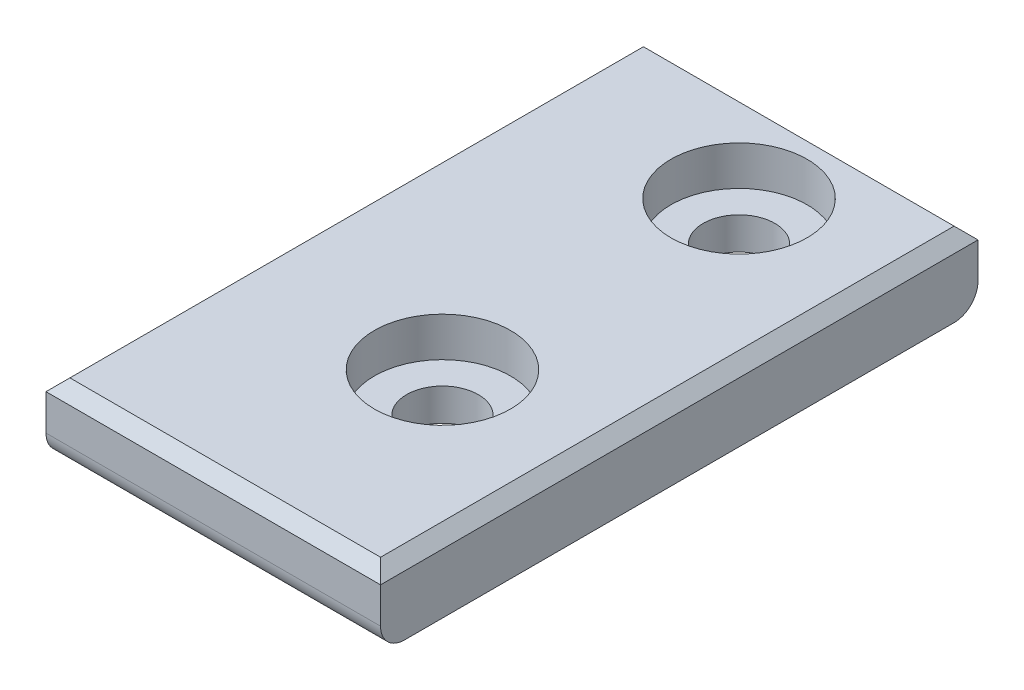
ISO-10303-21;
HEADER;
FILE_DESCRIPTION(('STEP AP214'),'2;1');
FILE_NAME('part.step','',(''),(''),'','','');
FILE_SCHEMA(('AUTOMOTIVE_DESIGN { 1 0 10303 214 1 1 1 1 }'));
ENDSEC;
DATA;
#1=APPLICATION_CONTEXT('core data for automotive mechanical design processes');
#2=APPLICATION_PROTOCOL_DEFINITION('international standard','automotive_design',2000,#1);
#3=PRODUCT_CONTEXT('',#1,'mechanical');
#4=PRODUCT('Part','Part','',(#3));
#5=PRODUCT_RELATED_PRODUCT_CATEGORY('part','',(#4));
#6=PRODUCT_DEFINITION_FORMATION('','',#4);
#7=PRODUCT_DEFINITION_CONTEXT('part definition',#1,'design');
#8=PRODUCT_DEFINITION('design','',#6,#7);
#9=PRODUCT_DEFINITION_SHAPE('','',#8);
#10=(LENGTH_UNIT() NAMED_UNIT(*) SI_UNIT(.MILLI.,.METRE.));
#11=(NAMED_UNIT(*) PLANE_ANGLE_UNIT() SI_UNIT($,.RADIAN.));
#12=(NAMED_UNIT(*) SI_UNIT($,.STERADIAN.) SOLID_ANGLE_UNIT());
#13=UNCERTAINTY_MEASURE_WITH_UNIT(LENGTH_MEASURE(1.E-05),#10,'distance_accuracy_value','');
#14=(GEOMETRIC_REPRESENTATION_CONTEXT(3) GLOBAL_UNCERTAINTY_ASSIGNED_CONTEXT((#13)) GLOBAL_UNIT_ASSIGNED_CONTEXT((#10,
#11,#12)) REPRESENTATION_CONTEXT('',''));
#15=CARTESIAN_POINT('',(0.,0.,0.));
#16=DIRECTION('',(0.,0.,1.));
#17=DIRECTION('',(1.,0.,0.));
#18=AXIS2_PLACEMENT_3D('',#15,#16,#17);
#19=CARTESIAN_POINT('',(0.,1.,-24.));
#20=DIRECTION('',(1.,0.,0.));
#21=DIRECTION('',(0.,0.,-1.));
#22=AXIS2_PLACEMENT_3D('',#19,#20,#21);
#23=CYLINDRICAL_SURFACE('',#22,1.);
#24=CARTESIAN_POINT('',(10.5,1.,-24.));
#25=DIRECTION('',(0.707106781186547,0.707106781186547,0.));
#26=DIRECTION('',(0.707106781186547,-0.707106781186547,0.));
#27=AXIS2_PLACEMENT_3D('',#24,#25,#26);
#28=ELLIPSE('',#27,1.41421356237309,1.);
#29=CARTESIAN_POINT('',(10.5,1.,-25.));
#30=VERTEX_POINT('',#29);
#31=CARTESIAN_POINT('',(11.5,0.,-24.));
#32=VERTEX_POINT('',#31);
#33=EDGE_CURVE('E11',#30,#32,#28,.F.);
#34=ORIENTED_EDGE('',*,*,#33,.F.);
#35=DIRECTION('',(-1.,0.,0.));
#36=VECTOR('',#35,1.);
#37=CARTESIAN_POINT('',(0.,1.,-25.));
#38=LINE('',#37,#36);
#39=CARTESIAN_POINT('',(14.,1.,-25.));
#40=VERTEX_POINT('',#39);
#41=EDGE_CURVE('E124',#40,#30,#38,.T.);
#42=ORIENTED_EDGE('',*,*,#41,.F.);
#43=CARTESIAN_POINT('',(14.,1.,-24.));
#44=DIRECTION('',(-1.,0.,0.));
#45=DIRECTION('',(0.,0.,1.));
#46=AXIS2_PLACEMENT_3D('',#43,#44,#45);
#47=CIRCLE('',#46,1.);
#48=CARTESIAN_POINT('',(14.,0.,-24.));
#49=VERTEX_POINT('',#48);
#50=EDGE_CURVE('E169',#49,#40,#47,.F.);
#51=ORIENTED_EDGE('',*,*,#50,.F.);
#52=DIRECTION('',(-1.,0.,0.));
#53=VECTOR('',#52,1.);
#54=CARTESIAN_POINT('',(14.,0.,-24.));
#55=LINE('',#54,#53);
#56=EDGE_CURVE('E173',#32,#49,#55,.F.);
#57=ORIENTED_EDGE('',*,*,#56,.F.);
#58=EDGE_LOOP('',(#34,#42,#51,#57));
#59=FACE_BOUND('',#58,.T.);
#60=ADVANCED_FACE('F32',(#59),#23,.T.);
#61=CARTESIAN_POINT('',(8.,3.,-21.));
#62=DIRECTION('',(0.,-1.,0.));
#63=DIRECTION('',(0.,0.,-1.));
#64=AXIS2_PLACEMENT_3D('',#61,#62,#63);
#65=CYLINDRICAL_SURFACE('',#64,1.5);
#66=CARTESIAN_POINT('',(8.,0.,-21.));
#67=DIRECTION('',(0.,1.,0.));
#68=DIRECTION('',(0.,0.,1.));
#69=AXIS2_PLACEMENT_3D('',#66,#67,#68);
#70=CIRCLE('',#69,1.5);
#71=CARTESIAN_POINT('',(8.,0.,-19.5));
#72=VERTEX_POINT('',#71);
#73=EDGE_CURVE('E189',#72,#72,#70,.T.);
#74=ORIENTED_EDGE('',*,*,#73,.F.);
#75=EDGE_LOOP('',(#74));
#76=FACE_BOUND('',#75,.T.);
#77=CARTESIAN_POINT('',(8.,1.35,-21.));
#78=DIRECTION('',(0.,1.,0.));
#79=DIRECTION('',(0.,0.,1.));
#80=AXIS2_PLACEMENT_3D('',#77,#78,#79);
#81=CIRCLE('',#80,1.5);
#82=CARTESIAN_POINT('',(8.,1.35,-19.5));
#83=VERTEX_POINT('',#82);
#84=EDGE_CURVE('E141',#83,#83,#81,.T.);
#85=ORIENTED_EDGE('',*,*,#84,.T.);
#86=EDGE_LOOP('',(#85));
#87=FACE_BOUND('',#86,.T.);
#88=ADVANCED_FACE('F256',(#76,#87),#65,.F.);
#89=CARTESIAN_POINT('',(8.,3.,-8.5895));
#90=DIRECTION('',(0.,-1.,0.));
#91=DIRECTION('',(0.,0.,-1.));
#92=AXIS2_PLACEMENT_3D('',#89,#90,#91);
#93=CYLINDRICAL_SURFACE('',#92,1.5);
#94=CARTESIAN_POINT('',(8.,0.,-8.5895));
#95=DIRECTION('',(0.,1.,0.));
#96=DIRECTION('',(0.,0.,1.));
#97=AXIS2_PLACEMENT_3D('',#94,#95,#96);
#98=CIRCLE('',#97,1.5);
#99=CARTESIAN_POINT('',(8.,0.,-7.0895));
#100=VERTEX_POINT('',#99);
#101=EDGE_CURVE('E165',#100,#100,#98,.T.);
#102=ORIENTED_EDGE('',*,*,#101,.F.);
#103=EDGE_LOOP('',(#102));
#104=FACE_BOUND('',#103,.T.);
#105=CARTESIAN_POINT('',(8.,1.35,-8.5895));
#106=DIRECTION('',(0.,1.,0.));
#107=DIRECTION('',(0.,0.,1.));
#108=AXIS2_PLACEMENT_3D('',#105,#106,#107);
#109=CIRCLE('',#108,1.5);
#110=CARTESIAN_POINT('',(8.,1.35,-7.0895));
#111=VERTEX_POINT('',#110);
#112=EDGE_CURVE('E138',#111,#111,#109,.T.);
#113=ORIENTED_EDGE('',*,*,#112,.T.);
#114=EDGE_LOOP('',(#113));
#115=FACE_BOUND('',#114,.T.);
#116=ADVANCED_FACE('F261',(#104,#115),#93,.F.);
#117=CARTESIAN_POINT('',(0.,3.,0.));
#118=DIRECTION('',(0.,-1.,0.));
#119=DIRECTION('',(0.,0.,-1.));
#120=AXIS2_PLACEMENT_3D('',#117,#118,#119);
#121=PLANE('',#120);
#122=CARTESIAN_POINT('',(8.,3.,-21.));
#123=DIRECTION('',(0.,1.,0.));
#124=DIRECTION('',(0.,0.,1.));
#125=AXIS2_PLACEMENT_3D('',#122,#123,#124);
#126=CIRCLE('',#125,2.85);
#127=CARTESIAN_POINT('',(8.,3.,-18.15));
#128=VERTEX_POINT('',#127);
#129=EDGE_CURVE('E433',#128,#128,#126,.T.);
#130=ORIENTED_EDGE('',*,*,#129,.F.);
#131=EDGE_LOOP('',(#130));
#132=FACE_BOUND('',#131,.T.);
#133=CARTESIAN_POINT('',(8.,3.,-8.5895));
#134=DIRECTION('',(0.,1.,0.));
#135=DIRECTION('',(0.,0.,1.));
#136=AXIS2_PLACEMENT_3D('',#133,#134,#135);
#137=CIRCLE('',#136,2.85);
#138=CARTESIAN_POINT('',(8.,3.,-5.7395));
#139=VERTEX_POINT('',#138);
#140=EDGE_CURVE('E421',#139,#139,#137,.T.);
#141=ORIENTED_EDGE('',*,*,#140,.F.);
#142=EDGE_LOOP('',(#141));
#143=FACE_BOUND('',#142,.T.);
#144=DIRECTION('',(0.,0.,-1.));
#145=VECTOR('',#144,1.);
#146=CARTESIAN_POINT('',(13.5,3.,0.));
#147=LINE('',#146,#145);
#148=CARTESIAN_POINT('',(13.5,3.,-0.499999999999994));
#149=VERTEX_POINT('',#148);
#150=CARTESIAN_POINT('',(13.5,3.,-24.5));
#151=VERTEX_POINT('',#150);
#152=EDGE_CURVE('E206',#149,#151,#147,.T.);
#153=ORIENTED_EDGE('',*,*,#152,.T.);
#154=DIRECTION('',(-1.,0.,0.));
#155=VECTOR('',#154,1.);
#156=CARTESIAN_POINT('',(0.,3.,-24.5));
#157=LINE('',#156,#155);
#158=CARTESIAN_POINT('',(0.499999999999994,3.,-24.5));
#159=VERTEX_POINT('',#158);
#160=EDGE_CURVE('E212',#151,#159,#157,.T.);
#161=ORIENTED_EDGE('',*,*,#160,.T.);
#162=DIRECTION('',(0.,0.,1.));
#163=VECTOR('',#162,1.);
#164=CARTESIAN_POINT('',(0.499999999999994,3.,0.));
#165=LINE('',#164,#163);
#166=CARTESIAN_POINT('',(0.499999999999994,3.,-0.499999999999994));
#167=VERTEX_POINT('',#166);
#168=EDGE_CURVE('E210',#159,#167,#165,.T.);
#169=ORIENTED_EDGE('',*,*,#168,.T.);
#170=DIRECTION('',(1.,0.,0.));
#171=VECTOR('',#170,1.);
#172=CARTESIAN_POINT('',(0.,3.,-0.499999999999994));
#173=LINE('',#172,#171);
#174=EDGE_CURVE('E208',#167,#149,#173,.T.);
#175=ORIENTED_EDGE('',*,*,#174,.T.);
#176=EDGE_LOOP('',(#153,#161,#169,#175));
#177=FACE_BOUND('',#176,.T.);
#178=ADVANCED_FACE('F241',(#132,#143,#177),#121,.F.);
#179=CARTESIAN_POINT('',(0.,0.,0.));
#180=DIRECTION('',(0.,-1.,0.));
#181=DIRECTION('',(0.,0.,-1.));
#182=AXIS2_PLACEMENT_3D('',#179,#180,#181);
#183=PLANE('',#182);
#184=CARTESIAN_POINT('',(0.,0.,-24.));
#185=VERTEX_POINT('',#184);
#186=CARTESIAN_POINT('',(4.5,0.,-24.));
#187=VERTEX_POINT('',#186);
#188=EDGE_CURVE('E174',#185,#187,#55,.F.);
#189=ORIENTED_EDGE('',*,*,#188,.T.);
#190=CARTESIAN_POINT('',(5.5,0.,-24.));
#191=DIRECTION('',(0.,-1.,0.));
#192=DIRECTION('',(0.,0.,-1.));
#193=AXIS2_PLACEMENT_3D('',#190,#191,#192);
#194=CIRCLE('',#193,1.);
#195=CARTESIAN_POINT('',(5.5,0.,-25.));
#196=VERTEX_POINT('',#195);
#197=EDGE_CURVE('E120',#187,#196,#194,.T.);
#198=ORIENTED_EDGE('',*,*,#197,.T.);
#199=DIRECTION('',(1.,0.,0.));
#200=VECTOR('',#199,1.);
#201=CARTESIAN_POINT('',(5.50000000000001,0.,-25.));
#202=LINE('',#201,#200);
#203=CARTESIAN_POINT('',(10.5,0.,-25.));
#204=VERTEX_POINT('',#203);
#205=EDGE_CURVE('E127',#196,#204,#202,.T.);
#206=ORIENTED_EDGE('',*,*,#205,.T.);
#207=CARTESIAN_POINT('',(10.5,0.,-24.));
#208=DIRECTION('',(0.,-1.,0.));
#209=DIRECTION('',(0.,0.,-1.));
#210=AXIS2_PLACEMENT_3D('',#207,#208,#209);
#211=CIRCLE('',#210,1.);
#212=EDGE_CURVE('E47',#204,#32,#211,.T.);
#213=ORIENTED_EDGE('',*,*,#212,.T.);
#214=ORIENTED_EDGE('',*,*,#56,.T.);
#215=DIRECTION('',(0.,0.,-1.));
#216=VECTOR('',#215,1.);
#217=CARTESIAN_POINT('',(14.,0.,0.));
#218=LINE('',#217,#216);
#219=CARTESIAN_POINT('',(14.,0.,-1.));
#220=VERTEX_POINT('',#219);
#221=EDGE_CURVE('E188',#220,#49,#218,.T.);
#222=ORIENTED_EDGE('',*,*,#221,.F.);
#223=DIRECTION('',(1.,0.,0.));
#224=VECTOR('',#223,1.);
#225=CARTESIAN_POINT('',(0.,0.,-1.));
#226=LINE('',#225,#224);
#227=CARTESIAN_POINT('',(0.,0.,-1.));
#228=VERTEX_POINT('',#227);
#229=EDGE_CURVE('E176',#220,#228,#226,.F.);
#230=ORIENTED_EDGE('',*,*,#229,.T.);
#231=DIRECTION('',(0.,0.,1.));
#232=VECTOR('',#231,1.);
#233=CARTESIAN_POINT('',(0.,0.,0.));
#234=LINE('',#233,#232);
#235=EDGE_CURVE('E181',#185,#228,#234,.T.);
#236=ORIENTED_EDGE('',*,*,#235,.F.);
#237=EDGE_LOOP('',(#189,#198,#206,#213,#214,#222,#230,#236));
#238=FACE_BOUND('',#237,.T.);
#239=ORIENTED_EDGE('',*,*,#73,.T.);
#240=EDGE_LOOP('',(#239));
#241=FACE_BOUND('',#240,.T.);
#242=ORIENTED_EDGE('',*,*,#101,.T.);
#243=EDGE_LOOP('',(#242));
#244=FACE_BOUND('',#243,.T.);
#245=ADVANCED_FACE('F184',(#238,#241,#244),#183,.T.);
#246=CARTESIAN_POINT('',(0.,3.,0.));
#247=DIRECTION('',(1.,0.,0.));
#248=DIRECTION('',(0.,0.,-1.));
#249=AXIS2_PLACEMENT_3D('',#246,#247,#248);
#250=PLANE('',#249);
#251=ORIENTED_EDGE('',*,*,#235,.T.);
#252=CARTESIAN_POINT('',(0.,1.,-1.));
#253=DIRECTION('',(1.,0.,0.));
#254=DIRECTION('',(0.,0.,-1.));
#255=AXIS2_PLACEMENT_3D('',#252,#253,#254);
#256=CIRCLE('',#255,1.);
#257=CARTESIAN_POINT('',(0.,1.,0.));
#258=VERTEX_POINT('',#257);
#259=EDGE_CURVE('E132',#228,#258,#256,.F.);
#260=ORIENTED_EDGE('',*,*,#259,.T.);
#261=DIRECTION('',(0.,-1.,0.));
#262=VECTOR('',#261,1.);
#263=CARTESIAN_POINT('',(0.,3.,0.));
#264=LINE('',#263,#262);
#265=CARTESIAN_POINT('',(0.,2.5,0.));
#266=VERTEX_POINT('',#265);
#267=EDGE_CURVE('E203',#266,#258,#264,.T.);
#268=ORIENTED_EDGE('',*,*,#267,.F.);
#269=DIRECTION('',(0.,0.,-1.));
#270=VECTOR('',#269,1.);
#271=CARTESIAN_POINT('',(0.,2.5,0.));
#272=LINE('',#271,#270);
#273=CARTESIAN_POINT('',(0.,2.5,-25.));
#274=VERTEX_POINT('',#273);
#275=EDGE_CURVE('E218',#266,#274,#272,.T.);
#276=ORIENTED_EDGE('',*,*,#275,.T.);
#277=DIRECTION('',(0.,-1.,0.));
#278=VECTOR('',#277,1.);
#279=CARTESIAN_POINT('',(0.,3.,-25.));
#280=LINE('',#279,#278);
#281=CARTESIAN_POINT('',(0.,1.,-25.));
#282=VERTEX_POINT('',#281);
#283=EDGE_CURVE('E183',#274,#282,#280,.T.);
#284=ORIENTED_EDGE('',*,*,#283,.T.);
#285=CARTESIAN_POINT('',(0.,1.,-24.));
#286=DIRECTION('',(1.,0.,0.));
#287=DIRECTION('',(0.,0.,-1.));
#288=AXIS2_PLACEMENT_3D('',#285,#286,#287);
#289=CIRCLE('',#288,1.);
#290=EDGE_CURVE('E130',#282,#185,#289,.F.);
#291=ORIENTED_EDGE('',*,*,#290,.T.);
#292=EDGE_LOOP('',(#251,#260,#268,#276,#284,#291));
#293=FACE_BOUND('',#292,.T.);
#294=ADVANCED_FACE('F180',(#293),#250,.F.);
#295=CARTESIAN_POINT('',(0.,3.,0.));
#296=DIRECTION('',(0.,0.,-1.));
#297=DIRECTION('',(-1.,0.,0.));
#298=AXIS2_PLACEMENT_3D('',#295,#296,#297);
#299=PLANE('',#298);
#300=ORIENTED_EDGE('',*,*,#267,.T.);
#301=DIRECTION('',(1.,0.,0.));
#302=VECTOR('',#301,1.);
#303=CARTESIAN_POINT('',(14.,1.,0.));
#304=LINE('',#303,#302);
#305=CARTESIAN_POINT('',(14.,1.,0.));
#306=VERTEX_POINT('',#305);
#307=EDGE_CURVE('E166',#258,#306,#304,.T.);
#308=ORIENTED_EDGE('',*,*,#307,.T.);
#309=DIRECTION('',(0.,-1.,0.));
#310=VECTOR('',#309,1.);
#311=CARTESIAN_POINT('',(14.,3.,0.));
#312=LINE('',#311,#310);
#313=CARTESIAN_POINT('',(14.,2.5,0.));
#314=VERTEX_POINT('',#313);
#315=EDGE_CURVE('E200',#314,#306,#312,.T.);
#316=ORIENTED_EDGE('',*,*,#315,.F.);
#317=DIRECTION('',(-1.,0.,0.));
#318=VECTOR('',#317,1.);
#319=CARTESIAN_POINT('',(0.,2.5,0.));
#320=LINE('',#319,#318);
#321=EDGE_CURVE('E219',#314,#266,#320,.T.);
#322=ORIENTED_EDGE('',*,*,#321,.T.);
#323=EDGE_LOOP('',(#300,#308,#316,#322));
#324=FACE_BOUND('',#323,.T.);
#325=ADVANCED_FACE('F230',(#324),#299,.F.);
#326=CARTESIAN_POINT('',(14.,3.,0.));
#327=DIRECTION('',(-1.,0.,0.));
#328=DIRECTION('',(0.,0.,1.));
#329=AXIS2_PLACEMENT_3D('',#326,#327,#328);
#330=PLANE('',#329);
#331=ORIENTED_EDGE('',*,*,#315,.T.);
#332=CARTESIAN_POINT('',(14.,1.,-1.));
#333=DIRECTION('',(-1.,0.,0.));
#334=DIRECTION('',(0.,0.,1.));
#335=AXIS2_PLACEMENT_3D('',#332,#333,#334);
#336=CIRCLE('',#335,1.);
#337=EDGE_CURVE('E171',#306,#220,#336,.F.);
#338=ORIENTED_EDGE('',*,*,#337,.T.);
#339=ORIENTED_EDGE('',*,*,#221,.T.);
#340=ORIENTED_EDGE('',*,*,#50,.T.);
#341=DIRECTION('',(0.,-1.,0.));
#342=VECTOR('',#341,1.);
#343=CARTESIAN_POINT('',(14.,3.,-25.));
#344=LINE('',#343,#342);
#345=CARTESIAN_POINT('',(14.,2.5,-25.));
#346=VERTEX_POINT('',#345);
#347=EDGE_CURVE('E198',#346,#40,#344,.T.);
#348=ORIENTED_EDGE('',*,*,#347,.F.);
#349=DIRECTION('',(0.,0.,1.));
#350=VECTOR('',#349,1.);
#351=CARTESIAN_POINT('',(14.,2.5,0.));
#352=LINE('',#351,#350);
#353=EDGE_CURVE('E157',#346,#314,#352,.T.);
#354=ORIENTED_EDGE('',*,*,#353,.T.);
#355=EDGE_LOOP('',(#331,#338,#339,#340,#348,#354));
#356=FACE_BOUND('',#355,.T.);
#357=ADVANCED_FACE('F227',(#356),#330,.F.);
#358=CARTESIAN_POINT('',(0.,3.,-25.));
#359=DIRECTION('',(0.,0.,1.));
#360=DIRECTION('',(1.,0.,0.));
#361=AXIS2_PLACEMENT_3D('',#358,#359,#360);
#362=PLANE('',#361);
#363=ORIENTED_EDGE('',*,*,#347,.T.);
#364=ORIENTED_EDGE('',*,*,#41,.T.);
#365=DIRECTION('',(0.,-1.,0.));
#366=VECTOR('',#365,1.);
#367=CARTESIAN_POINT('',(10.5,1.,-25.));
#368=LINE('',#367,#366);
#369=EDGE_CURVE('E128',#30,#204,#368,.T.);
#370=ORIENTED_EDGE('',*,*,#369,.T.);
#371=ORIENTED_EDGE('',*,*,#205,.F.);
#372=DIRECTION('',(0.,-1.,0.));
#373=VECTOR('',#372,1.);
#374=CARTESIAN_POINT('',(5.5,1.,-25.));
#375=LINE('',#374,#373);
#376=CARTESIAN_POINT('',(5.5,1.,-25.));
#377=VERTEX_POINT('',#376);
#378=EDGE_CURVE('E117',#377,#196,#375,.T.);
#379=ORIENTED_EDGE('',*,*,#378,.F.);
#380=EDGE_CURVE('E54',#377,#282,#38,.T.);
#381=ORIENTED_EDGE('',*,*,#380,.T.);
#382=ORIENTED_EDGE('',*,*,#283,.F.);
#383=DIRECTION('',(1.,0.,0.));
#384=VECTOR('',#383,1.);
#385=CARTESIAN_POINT('',(0.,2.5,-25.));
#386=LINE('',#385,#384);
#387=EDGE_CURVE('E215',#274,#346,#386,.T.);
#388=ORIENTED_EDGE('',*,*,#387,.T.);
#389=EDGE_LOOP('',(#363,#364,#370,#371,#379,#381,#382,#388));
#390=FACE_BOUND('',#389,.T.);
#391=ADVANCED_FACE('F126',(#390),#362,.F.);
#392=CARTESIAN_POINT('',(0.,3.,-0.499999999999994));
#393=DIRECTION('',(0.,-0.707106781186545,-0.70710678118655));
#394=DIRECTION('',(1.,0.,0.));
#395=AXIS2_PLACEMENT_3D('',#392,#393,#394);
#396=PLANE('',#395);
#397=DIRECTION('',(-0.577350269189625,-0.577350269189629,0.577350269189625));
#398=VECTOR('',#397,1.);
#399=CARTESIAN_POINT('',(0.33333333333333,2.83333333333334,-0.33333333333333));
#400=LINE('',#399,#398);
#401=EDGE_CURVE('E154',#266,#167,#400,.F.);
#402=ORIENTED_EDGE('',*,*,#401,.F.);
#403=ORIENTED_EDGE('',*,*,#321,.F.);
#404=DIRECTION('',(0.577350269189625,-0.577350269189629,0.577350269189625));
#405=VECTOR('',#404,1.);
#406=CARTESIAN_POINT('',(13.6666666666667,2.83333333333334,-0.33333333333333));
#407=LINE('',#406,#405);
#408=EDGE_CURVE('E162',#149,#314,#407,.T.);
#409=ORIENTED_EDGE('',*,*,#408,.F.);
#410=ORIENTED_EDGE('',*,*,#174,.F.);
#411=EDGE_LOOP('',(#402,#403,#409,#410));
#412=FACE_BOUND('',#411,.T.);
#413=ADVANCED_FACE('F235',(#412),#396,.F.);
#414=CARTESIAN_POINT('',(13.5,3.,0.));
#415=DIRECTION('',(-0.70710678118655,-0.707106781186545,0.));
#416=DIRECTION('',(0.,0.,-1.));
#417=AXIS2_PLACEMENT_3D('',#414,#415,#416);
#418=PLANE('',#417);
#419=ORIENTED_EDGE('',*,*,#408,.T.);
#420=ORIENTED_EDGE('',*,*,#353,.F.);
#421=DIRECTION('',(-0.577350269189625,0.577350269189629,0.577350269189625));
#422=VECTOR('',#421,1.);
#423=CARTESIAN_POINT('',(5.33333333333338,11.1666666666667,-16.3333333333334));
#424=LINE('',#423,#422);
#425=EDGE_CURVE('E147',#151,#346,#424,.F.);
#426=ORIENTED_EDGE('',*,*,#425,.F.);
#427=ORIENTED_EDGE('',*,*,#152,.F.);
#428=EDGE_LOOP('',(#419,#420,#426,#427));
#429=FACE_BOUND('',#428,.T.);
#430=ADVANCED_FACE('F239',(#429),#418,.F.);
#431=CARTESIAN_POINT('',(0.499999999999994,3.,0.));
#432=DIRECTION('',(0.70710678118655,-0.707106781186545,0.));
#433=DIRECTION('',(0.,0.,1.));
#434=AXIS2_PLACEMENT_3D('',#431,#432,#433);
#435=PLANE('',#434);
#436=ORIENTED_EDGE('',*,*,#401,.T.);
#437=ORIENTED_EDGE('',*,*,#168,.F.);
#438=DIRECTION('',(-0.577350269189625,-0.577350269189629,-0.577350269189625));
#439=VECTOR('',#438,1.);
#440=CARTESIAN_POINT('',(8.66666666666662,11.1666666666667,-16.3333333333334));
#441=LINE('',#440,#439);
#442=EDGE_CURVE('E144',#274,#159,#441,.F.);
#443=ORIENTED_EDGE('',*,*,#442,.F.);
#444=ORIENTED_EDGE('',*,*,#275,.F.);
#445=EDGE_LOOP('',(#436,#437,#443,#444));
#446=FACE_BOUND('',#445,.T.);
#447=ADVANCED_FACE('F243',(#446),#435,.F.);
#448=CARTESIAN_POINT('',(0.,3.,-24.5));
#449=DIRECTION('',(0.,-0.707106781186545,0.70710678118655));
#450=DIRECTION('',(-1.,0.,0.));
#451=AXIS2_PLACEMENT_3D('',#448,#449,#450);
#452=PLANE('',#451);
#453=ORIENTED_EDGE('',*,*,#425,.T.);
#454=ORIENTED_EDGE('',*,*,#387,.F.);
#455=ORIENTED_EDGE('',*,*,#442,.T.);
#456=ORIENTED_EDGE('',*,*,#160,.F.);
#457=EDGE_LOOP('',(#453,#454,#455,#456));
#458=FACE_BOUND('',#457,.T.);
#459=ADVANCED_FACE('F244',(#458),#452,.F.);
#460=CARTESIAN_POINT('',(0.,1.,-1.));
#461=DIRECTION('',(-1.,0.,0.));
#462=DIRECTION('',(0.,0.,1.));
#463=AXIS2_PLACEMENT_3D('',#460,#461,#462);
#464=CYLINDRICAL_SURFACE('',#463,1.);
#465=ORIENTED_EDGE('',*,*,#259,.F.);
#466=ORIENTED_EDGE('',*,*,#229,.F.);
#467=ORIENTED_EDGE('',*,*,#337,.F.);
#468=ORIENTED_EDGE('',*,*,#307,.F.);
#469=EDGE_LOOP('',(#465,#466,#467,#468));
#470=FACE_BOUND('',#469,.T.);
#471=ADVANCED_FACE('F246',(#470),#464,.T.);
#472=CARTESIAN_POINT('',(5.5,1.,-24.));
#473=DIRECTION('',(0.707106781186547,-0.707106781186547,0.));
#474=DIRECTION('',(0.707106781186547,0.707106781186547,0.));
#475=AXIS2_PLACEMENT_3D('',#472,#473,#474);
#476=ELLIPSE('',#475,1.4142135623731,1.);
#477=EDGE_CURVE('E40',#187,#377,#476,.T.);
#478=ORIENTED_EDGE('',*,*,#477,.F.);
#479=ORIENTED_EDGE('',*,*,#188,.F.);
#480=ORIENTED_EDGE('',*,*,#290,.F.);
#481=ORIENTED_EDGE('',*,*,#380,.F.);
#482=EDGE_LOOP('',(#478,#479,#480,#481));
#483=FACE_BOUND('',#482,.T.);
#484=ADVANCED_FACE('F34',(#483),#23,.T.);
#485=CARTESIAN_POINT('',(8.,1.35,-8.5895));
#486=DIRECTION('',(0.,1.,0.));
#487=DIRECTION('',(0.,0.,1.));
#488=AXIS2_PLACEMENT_3D('',#485,#486,#487);
#489=CYLINDRICAL_SURFACE('',#488,2.85);
#490=CARTESIAN_POINT('',(8.,1.35,-8.5895));
#491=DIRECTION('',(0.,1.,0.));
#492=DIRECTION('',(0.,0.,1.));
#493=AXIS2_PLACEMENT_3D('',#490,#491,#492);
#494=CIRCLE('',#493,2.85);
#495=CARTESIAN_POINT('',(8.,1.35,-5.7395));
#496=VERTEX_POINT('',#495);
#497=EDGE_CURVE('E426',#496,#496,#494,.T.);
#498=ORIENTED_EDGE('',*,*,#497,.F.);
#499=EDGE_LOOP('',(#498));
#500=FACE_BOUND('',#499,.T.);
#501=ORIENTED_EDGE('',*,*,#140,.T.);
#502=EDGE_LOOP('',(#501));
#503=FACE_BOUND('',#502,.T.);
#504=ADVANCED_FACE('F266',(#500,#503),#489,.F.);
#505=CARTESIAN_POINT('',(8.,1.35,-8.5895));
#506=DIRECTION('',(0.,1.,0.));
#507=DIRECTION('',(0.,0.,1.));
#508=AXIS2_PLACEMENT_3D('',#505,#506,#507);
#509=PLANE('',#508);
#510=ORIENTED_EDGE('',*,*,#112,.F.);
#511=EDGE_LOOP('',(#510));
#512=FACE_BOUND('',#511,.T.);
#513=ORIENTED_EDGE('',*,*,#497,.T.);
#514=EDGE_LOOP('',(#513));
#515=FACE_BOUND('',#514,.T.);
#516=ADVANCED_FACE('F270',(#512,#515),#509,.T.);
#517=CARTESIAN_POINT('',(8.,1.35,-21.));
#518=DIRECTION('',(0.,1.,0.));
#519=DIRECTION('',(0.,0.,1.));
#520=AXIS2_PLACEMENT_3D('',#517,#518,#519);
#521=CYLINDRICAL_SURFACE('',#520,2.85);
#522=CARTESIAN_POINT('',(8.,1.35,-21.));
#523=DIRECTION('',(0.,1.,0.));
#524=DIRECTION('',(0.,0.,1.));
#525=AXIS2_PLACEMENT_3D('',#522,#523,#524);
#526=CIRCLE('',#525,2.85);
#527=CARTESIAN_POINT('',(8.,1.35,-18.15));
#528=VERTEX_POINT('',#527);
#529=EDGE_CURVE('E142',#528,#528,#526,.T.);
#530=ORIENTED_EDGE('',*,*,#529,.F.);
#531=EDGE_LOOP('',(#530));
#532=FACE_BOUND('',#531,.T.);
#533=ORIENTED_EDGE('',*,*,#129,.T.);
#534=EDGE_LOOP('',(#533));
#535=FACE_BOUND('',#534,.T.);
#536=ADVANCED_FACE('F276',(#532,#535),#521,.F.);
#537=CARTESIAN_POINT('',(8.,1.35,-21.));
#538=DIRECTION('',(0.,1.,0.));
#539=DIRECTION('',(0.,0.,1.));
#540=AXIS2_PLACEMENT_3D('',#537,#538,#539);
#541=PLANE('',#540);
#542=ORIENTED_EDGE('',*,*,#84,.F.);
#543=EDGE_LOOP('',(#542));
#544=FACE_BOUND('',#543,.T.);
#545=ORIENTED_EDGE('',*,*,#529,.T.);
#546=EDGE_LOOP('',(#545));
#547=FACE_BOUND('',#546,.T.);
#548=ADVANCED_FACE('F373',(#544,#547),#541,.T.);
#549=CARTESIAN_POINT('',(10.5,1.,-24.));
#550=DIRECTION('',(0.,-1.,0.));
#551=DIRECTION('',(0.,0.,-1.));
#552=AXIS2_PLACEMENT_3D('',#549,#550,#551);
#553=CYLINDRICAL_SURFACE('',#552,1.);
#554=ORIENTED_EDGE('',*,*,#369,.F.);
#555=ORIENTED_EDGE('',*,*,#33,.T.);
#556=ORIENTED_EDGE('',*,*,#212,.F.);
#557=EDGE_LOOP('',(#554,#555,#556));
#558=FACE_BOUND('',#557,.T.);
#559=ADVANCED_FACE('F381',(#558),#553,.T.);
#560=CARTESIAN_POINT('',(5.5,1.,-24.));
#561=DIRECTION('',(0.,-1.,0.));
#562=DIRECTION('',(0.,0.,-1.));
#563=AXIS2_PLACEMENT_3D('',#560,#561,#562);
#564=CYLINDRICAL_SURFACE('',#563,1.);
#565=ORIENTED_EDGE('',*,*,#197,.F.);
#566=ORIENTED_EDGE('',*,*,#477,.T.);
#567=ORIENTED_EDGE('',*,*,#378,.T.);
#568=EDGE_LOOP('',(#565,#566,#567));
#569=FACE_BOUND('',#568,.T.);
#570=ADVANCED_FACE('F116',(#569),#564,.T.);
#571=CLOSED_SHELL('',(#60,#88,#116,#178,#245,#294,#325,#357,#391,#413,#430,#447,#459,#471,#484,
#504,#516,#536,#548,#559,#570));
#572=MANIFOLD_SOLID_BREP('B2',#571);
#573=ADVANCED_BREP_SHAPE_REPRESENTATION('',(#18,#572),#14);
#574=SHAPE_DEFINITION_REPRESENTATION(#9,#573);
ENDSEC;
END-ISO-10303-21;
